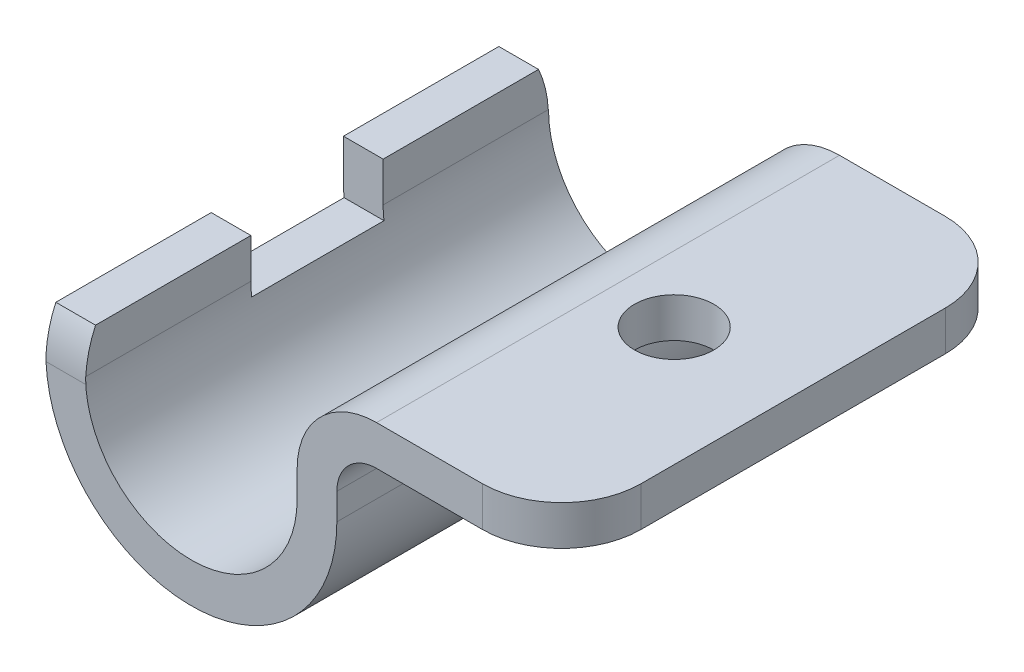
ISO-10303-21;
HEADER;
FILE_DESCRIPTION(('STEP AP214'),'2;1');
FILE_NAME('part.step','',(''),(''),'','','');
FILE_SCHEMA(('AUTOMOTIVE_DESIGN { 1 0 10303 214 1 1 1 1 }'));
ENDSEC;
DATA;
#1=APPLICATION_CONTEXT('core data for automotive mechanical design processes');
#2=APPLICATION_PROTOCOL_DEFINITION('international standard','automotive_design',2000,#1);
#3=PRODUCT_CONTEXT('',#1,'mechanical');
#4=PRODUCT('Part','Part','',(#3));
#5=PRODUCT_RELATED_PRODUCT_CATEGORY('part','',(#4));
#6=PRODUCT_DEFINITION_FORMATION('','',#4);
#7=PRODUCT_DEFINITION_CONTEXT('part definition',#1,'design');
#8=PRODUCT_DEFINITION('design','',#6,#7);
#9=PRODUCT_DEFINITION_SHAPE('','',#8);
#10=(LENGTH_UNIT() NAMED_UNIT(*) SI_UNIT(.MILLI.,.METRE.));
#11=(NAMED_UNIT(*) PLANE_ANGLE_UNIT() SI_UNIT($,.RADIAN.));
#12=(NAMED_UNIT(*) SI_UNIT($,.STERADIAN.) SOLID_ANGLE_UNIT());
#13=UNCERTAINTY_MEASURE_WITH_UNIT(LENGTH_MEASURE(1.E-05),#10,'distance_accuracy_value','');
#14=(GEOMETRIC_REPRESENTATION_CONTEXT(3) GLOBAL_UNCERTAINTY_ASSIGNED_CONTEXT((#13)) GLOBAL_UNIT_ASSIGNED_CONTEXT((#10,
#11,#12)) REPRESENTATION_CONTEXT('',''));
#15=CARTESIAN_POINT('',(0.,0.,0.));
#16=DIRECTION('',(0.,0.,1.));
#17=DIRECTION('',(1.,0.,0.));
#18=AXIS2_PLACEMENT_3D('',#15,#16,#17);
#19=CARTESIAN_POINT('',(-8.,0.,17.5));
#20=DIRECTION('',(-1.,0.,0.));
#21=DIRECTION('',(0.,0.,1.));
#22=AXIS2_PLACEMENT_3D('',#19,#20,#21);
#23=PLANE('',#22);
#24=DIRECTION('',(0.,0.,-1.));
#25=VECTOR('',#24,1.);
#26=CARTESIAN_POINT('',(-8.,3.,17.5));
#27=LINE('',#26,#25);
#28=CARTESIAN_POINT('',(-8.,3.,-5.));
#29=VERTEX_POINT('',#28);
#30=CARTESIAN_POINT('',(-8.,3.,-16.7459666924148));
#31=VERTEX_POINT('',#30);
#32=EDGE_CURVE('E215',#29,#31,#27,.T.);
#33=ORIENTED_EDGE('',*,*,#32,.F.);
#34=DIRECTION('',(0.,-1.,0.));
#35=VECTOR('',#34,1.);
#36=CARTESIAN_POINT('',(-8.,0.,-5.));
#37=LINE('',#36,#35);
#38=CARTESIAN_POINT('',(-8.,0.,-5.));
#39=VERTEX_POINT('',#38);
#40=EDGE_CURVE('E192',#29,#39,#37,.T.);
#41=ORIENTED_EDGE('',*,*,#40,.T.);
#42=DIRECTION('',(0.,0.,-1.));
#43=VECTOR('',#42,1.);
#44=CARTESIAN_POINT('',(-8.,0.,17.5));
#45=LINE('',#44,#43);
#46=CARTESIAN_POINT('',(-8.,0.,-17.4852813742386));
#47=VERTEX_POINT('',#46);
#48=EDGE_CURVE('E223',#39,#47,#45,.T.);
#49=ORIENTED_EDGE('',*,*,#48,.T.);
#50=CARTESIAN_POINT('',(-8.,-0.5,-9.));
#51=DIRECTION('',(1.,0.,0.));
#52=DIRECTION('',(0.,0.,1.));
#53=AXIS2_PLACEMENT_3D('',#50,#51,#52);
#54=CIRCLE('',#53,8.5);
#55=EDGE_CURVE('E439',#47,#31,#54,.T.);
#56=ORIENTED_EDGE('',*,*,#55,.T.);
#57=EDGE_LOOP('',(#33,#41,#49,#56));
#58=FACE_BOUND('',#57,.T.);
#59=ADVANCED_FACE('F31',(#58),#23,.F.);
#60=CARTESIAN_POINT('',(-11.,3.,17.5));
#61=DIRECTION('',(0.,-1.,0.));
#62=DIRECTION('',(0.,0.,-1.));
#63=AXIS2_PLACEMENT_3D('',#60,#61,#62);
#64=PLANE('',#63);
#65=DIRECTION('',(0.,0.,-1.));
#66=VECTOR('',#65,1.);
#67=CARTESIAN_POINT('',(-11.,3.,17.5));
#68=LINE('',#67,#66);
#69=CARTESIAN_POINT('',(-11.,3.,-5.));
#70=VERTEX_POINT('',#69);
#71=CARTESIAN_POINT('',(-11.,3.,-16.7459666924148));
#72=VERTEX_POINT('',#71);
#73=EDGE_CURVE('E203',#70,#72,#68,.T.);
#74=ORIENTED_EDGE('',*,*,#73,.F.);
#75=DIRECTION('',(1.,0.,0.));
#76=VECTOR('',#75,1.);
#77=CARTESIAN_POINT('',(-11.,3.,-5.));
#78=LINE('',#77,#76);
#79=EDGE_CURVE('E185',#70,#29,#78,.T.);
#80=ORIENTED_EDGE('',*,*,#79,.T.);
#81=ORIENTED_EDGE('',*,*,#32,.T.);
#82=DIRECTION('',(1.,0.,0.));
#83=VECTOR('',#82,1.);
#84=CARTESIAN_POINT('',(-43.,3.,-16.7459666924148));
#85=LINE('',#84,#83);
#86=EDGE_CURVE('E210',#72,#31,#85,.T.);
#87=ORIENTED_EDGE('',*,*,#86,.F.);
#88=EDGE_LOOP('',(#74,#80,#81,#87));
#89=FACE_BOUND('',#88,.T.);
#90=ADVANCED_FACE('F208',(#89),#64,.F.);
#91=CARTESIAN_POINT('',(-11.,0.,17.5));
#92=DIRECTION('',(1.,0.,0.));
#93=DIRECTION('',(0.,0.,-1.));
#94=AXIS2_PLACEMENT_3D('',#91,#92,#93);
#95=PLANE('',#94);
#96=DIRECTION('',(0.,0.,-1.));
#97=VECTOR('',#96,1.);
#98=CARTESIAN_POINT('',(-11.,0.,17.5));
#99=LINE('',#98,#97);
#100=CARTESIAN_POINT('',(-11.,0.,-5.));
#101=VERTEX_POINT('',#100);
#102=CARTESIAN_POINT('',(-11.,0.,-17.4852813742386));
#103=VERTEX_POINT('',#102);
#104=EDGE_CURVE('E205',#101,#103,#99,.T.);
#105=ORIENTED_EDGE('',*,*,#104,.F.);
#106=DIRECTION('',(0.,1.,0.));
#107=VECTOR('',#106,1.);
#108=CARTESIAN_POINT('',(-11.,3.,-5.));
#109=LINE('',#108,#107);
#110=EDGE_CURVE('E189',#101,#70,#109,.T.);
#111=ORIENTED_EDGE('',*,*,#110,.T.);
#112=ORIENTED_EDGE('',*,*,#73,.T.);
#113=CARTESIAN_POINT('',(-11.,-0.5,-9.));
#114=DIRECTION('',(1.,0.,0.));
#115=DIRECTION('',(0.,0.,-1.));
#116=AXIS2_PLACEMENT_3D('',#113,#114,#115);
#117=CIRCLE('',#116,8.5);
#118=EDGE_CURVE('E343',#103,#72,#117,.T.);
#119=ORIENTED_EDGE('',*,*,#118,.F.);
#120=EDGE_LOOP('',(#105,#111,#112,#119));
#121=FACE_BOUND('',#120,.T.);
#122=ADVANCED_FACE('F201',(#121),#95,.F.);
#123=CARTESIAN_POINT('',(-8.,0.,17.4852813742386));
#124=VERTEX_POINT('',#123);
#125=CARTESIAN_POINT('',(-8.,0.,5.));
#126=VERTEX_POINT('',#125);
#127=EDGE_CURVE('E227',#124,#126,#45,.T.);
#128=ORIENTED_EDGE('',*,*,#127,.T.);
#129=DIRECTION('',(0.,1.,0.));
#130=VECTOR('',#129,1.);
#131=CARTESIAN_POINT('',(-8.,0.,5.));
#132=LINE('',#131,#130);
#133=CARTESIAN_POINT('',(-8.,3.,5.));
#134=VERTEX_POINT('',#133);
#135=EDGE_CURVE('E46',#126,#134,#132,.T.);
#136=ORIENTED_EDGE('',*,*,#135,.T.);
#137=CARTESIAN_POINT('',(-8.,3.,16.7459666924148));
#138=VERTEX_POINT('',#137);
#139=EDGE_CURVE('E220',#138,#134,#27,.T.);
#140=ORIENTED_EDGE('',*,*,#139,.F.);
#141=CARTESIAN_POINT('',(-8.,-0.5,9.));
#142=DIRECTION('',(1.,0.,0.));
#143=DIRECTION('',(0.,0.,-1.));
#144=AXIS2_PLACEMENT_3D('',#141,#142,#143);
#145=CIRCLE('',#144,8.5);
#146=EDGE_CURVE('E300',#138,#124,#145,.T.);
#147=ORIENTED_EDGE('',*,*,#146,.T.);
#148=EDGE_LOOP('',(#128,#136,#140,#147));
#149=FACE_BOUND('',#148,.T.);
#150=ADVANCED_FACE('F435',(#149),#23,.F.);
#151=ORIENTED_EDGE('',*,*,#139,.T.);
#152=DIRECTION('',(1.,0.,0.));
#153=VECTOR('',#152,1.);
#154=CARTESIAN_POINT('',(-11.,3.,5.));
#155=LINE('',#154,#153);
#156=CARTESIAN_POINT('',(-11.,3.,5.));
#157=VERTEX_POINT('',#156);
#158=EDGE_CURVE('E196',#157,#134,#155,.T.);
#159=ORIENTED_EDGE('',*,*,#158,.F.);
#160=CARTESIAN_POINT('',(-11.,3.,16.7459666924148));
#161=VERTEX_POINT('',#160);
#162=EDGE_CURVE('E211',#161,#157,#68,.T.);
#163=ORIENTED_EDGE('',*,*,#162,.F.);
#164=DIRECTION('',(1.,0.,0.));
#165=VECTOR('',#164,1.);
#166=CARTESIAN_POINT('',(-43.,3.,16.7459666924148));
#167=LINE('',#166,#165);
#168=EDGE_CURVE('E433',#138,#161,#167,.F.);
#169=ORIENTED_EDGE('',*,*,#168,.F.);
#170=EDGE_LOOP('',(#151,#159,#163,#169));
#171=FACE_BOUND('',#170,.T.);
#172=ADVANCED_FACE('F430',(#171),#64,.F.);
#173=ORIENTED_EDGE('',*,*,#162,.T.);
#174=DIRECTION('',(0.,-1.,0.));
#175=VECTOR('',#174,1.);
#176=CARTESIAN_POINT('',(-11.,3.,5.));
#177=LINE('',#176,#175);
#178=CARTESIAN_POINT('',(-11.,0.,5.));
#179=VERTEX_POINT('',#178);
#180=EDGE_CURVE('E197',#157,#179,#177,.T.);
#181=ORIENTED_EDGE('',*,*,#180,.T.);
#182=CARTESIAN_POINT('',(-11.,0.,17.4852813742386));
#183=VERTEX_POINT('',#182);
#184=EDGE_CURVE('E212',#183,#179,#99,.T.);
#185=ORIENTED_EDGE('',*,*,#184,.F.);
#186=CARTESIAN_POINT('',(-11.,-0.5,9.));
#187=DIRECTION('',(1.,0.,0.));
#188=DIRECTION('',(0.,0.,-1.));
#189=AXIS2_PLACEMENT_3D('',#186,#187,#188);
#190=CIRCLE('',#189,8.5);
#191=EDGE_CURVE('E310',#161,#183,#190,.T.);
#192=ORIENTED_EDGE('',*,*,#191,.F.);
#193=EDGE_LOOP('',(#173,#181,#185,#192));
#194=FACE_BOUND('',#193,.T.);
#195=ADVANCED_FACE('F425',(#194),#95,.F.);
#196=CARTESIAN_POINT('',(0.,0.,17.5));
#197=DIRECTION('',(0.,0.,-1.));
#198=DIRECTION('',(-1.,0.,0.));
#199=AXIS2_PLACEMENT_3D('',#196,#197,#198);
#200=CYLINDRICAL_SURFACE('',#199,11.);
#201=DIRECTION('',(0.,0.,-1.));
#202=VECTOR('',#201,1.);
#203=CARTESIAN_POINT('',(-10.9544511501033,-1.,17.5));
#204=LINE('',#203,#202);
#205=CARTESIAN_POINT('',(-10.9544511501033,-1.,5.));
#206=VERTEX_POINT('',#205);
#207=CARTESIAN_POINT('',(-10.9544511501033,-1.,-5.));
#208=VERTEX_POINT('',#207);
#209=EDGE_CURVE('E295',#206,#208,#204,.T.);
#210=ORIENTED_EDGE('',*,*,#209,.T.);
#211=CARTESIAN_POINT('',(0.,0.,-5.));
#212=DIRECTION('',(0.,0.,-1.));
#213=DIRECTION('',(-1.,0.,0.));
#214=AXIS2_PLACEMENT_3D('',#211,#212,#213);
#215=CIRCLE('',#214,11.);
#216=EDGE_CURVE('E285',#208,#101,#215,.T.);
#217=ORIENTED_EDGE('',*,*,#216,.T.);
#218=ORIENTED_EDGE('',*,*,#104,.T.);
#219=CARTESIAN_POINT('',(-10.988630487918,-0.499999999999999,-17.5));
#220=CARTESIAN_POINT('',(-10.9924217220834,-0.416637552685752,-17.5000007370407));
#221=CARTESIAN_POINT('',(-10.9952647985063,-0.333289662361962,-17.4987745534142));
#222=CARTESIAN_POINT('',(-10.999054635867,-0.166622995695295,-17.4938683448271));
#223=CARTESIAN_POINT('',(-11.0000013968048,-0.0833042193524191,-17.4901883198664));
#224=CARTESIAN_POINT('',(-11.,0.,-17.4852813742386));
#225=B_SPLINE_CURVE_WITH_KNOTS('',3,(#219,#220,#221,#222,#223,#224),.UNSPECIFIED.,.F.,.F.,(4,2,
4),(0.,0.250216140329374,0.500432280658749),.UNSPECIFIED.);
#226=CARTESIAN_POINT('',(-10.988630487918,-0.499999999999999,-17.5));
#227=VERTEX_POINT('',#226);
#228=EDGE_CURVE('E336',#227,#103,#225,.T.);
#229=ORIENTED_EDGE('',*,*,#228,.F.);
#230=CARTESIAN_POINT('',(0.,0.,-17.5));
#231=DIRECTION('',(0.,0.,1.));
#232=DIRECTION('',(1.,0.,0.));
#233=AXIS2_PLACEMENT_3D('',#230,#231,#232);
#234=CIRCLE('',#233,11.);
#235=CARTESIAN_POINT('',(11.,0.,-17.5));
#236=VERTEX_POINT('',#235);
#237=EDGE_CURVE('E358',#227,#236,#234,.T.);
#238=ORIENTED_EDGE('',*,*,#237,.T.);
#239=DIRECTION('',(0.,0.,-1.));
#240=VECTOR('',#239,1.);
#241=CARTESIAN_POINT('',(11.,0.,17.5));
#242=LINE('',#241,#240);
#243=CARTESIAN_POINT('',(11.,0.,17.5));
#244=VERTEX_POINT('',#243);
#245=EDGE_CURVE('E393',#244,#236,#242,.T.);
#246=ORIENTED_EDGE('',*,*,#245,.F.);
#247=CARTESIAN_POINT('',(0.,0.,17.5));
#248=DIRECTION('',(0.,0.,1.));
#249=DIRECTION('',(1.,0.,0.));
#250=AXIS2_PLACEMENT_3D('',#247,#248,#249);
#251=CIRCLE('',#250,11.);
#252=CARTESIAN_POINT('',(-10.988630487918,-0.5,17.5));
#253=VERTEX_POINT('',#252);
#254=EDGE_CURVE('E376',#253,#244,#251,.T.);
#255=ORIENTED_EDGE('',*,*,#254,.F.);
#256=CARTESIAN_POINT('',(-11.,0.,17.4852813742386));
#257=CARTESIAN_POINT('',(-11.0000013968048,-0.0833042193524191,17.4901883198664));
#258=CARTESIAN_POINT('',(-10.999054635867,-0.166622995695295,17.493868344827));
#259=CARTESIAN_POINT('',(-10.9952647985063,-0.333289662361962,17.4987745534142));
#260=CARTESIAN_POINT('',(-10.9924217220834,-0.416637552685752,17.5000007370407));
#261=CARTESIAN_POINT('',(-10.988630487918,-0.499999999999999,17.5));
#262=B_SPLINE_CURVE_WITH_KNOTS('',3,(#256,#257,#258,#259,#260,#261),.UNSPECIFIED.,.F.,.F.,(4,2,
4),(0.,0.250216140329374,0.500432280658749),.UNSPECIFIED.);
#263=EDGE_CURVE('E303',#183,#253,#262,.T.);
#264=ORIENTED_EDGE('',*,*,#263,.F.);
#265=ORIENTED_EDGE('',*,*,#184,.T.);
#266=CARTESIAN_POINT('',(0.,0.,5.));
#267=DIRECTION('',(0.,0.,1.));
#268=DIRECTION('',(1.,0.,0.));
#269=AXIS2_PLACEMENT_3D('',#266,#267,#268);
#270=CIRCLE('',#269,11.);
#271=EDGE_CURVE('E287',#179,#206,#270,.T.);
#272=ORIENTED_EDGE('',*,*,#271,.T.);
#273=EDGE_LOOP('',(#210,#217,#218,#229,#238,#246,#255,#264,#265,#272));
#274=FACE_BOUND('',#273,.T.);
#275=ADVANCED_FACE('F312',(#274),#200,.T.);
#276=CARTESIAN_POINT('',(14.,2.,17.5));
#277=DIRECTION('',(0.,0.,-1.));
#278=DIRECTION('',(-1.,0.,0.));
#279=AXIS2_PLACEMENT_3D('',#276,#277,#278);
#280=PLANE('',#279);
#281=DIRECTION('',(1.,0.,0.));
#282=VECTOR('',#281,1.);
#283=CARTESIAN_POINT('',(-43.,-0.5,17.5));
#284=LINE('',#283,#282);
#285=CARTESIAN_POINT('',(-8.,-0.5,17.5));
#286=VERTEX_POINT('',#285);
#287=EDGE_CURVE('E268',#253,#286,#284,.T.);
#288=ORIENTED_EDGE('',*,*,#287,.F.);
#289=ORIENTED_EDGE('',*,*,#254,.T.);
#290=DIRECTION('',(0.,1.,0.));
#291=VECTOR('',#290,1.);
#292=CARTESIAN_POINT('',(11.,1.99999999999998,17.5));
#293=LINE('',#292,#291);
#294=CARTESIAN_POINT('',(11.,1.99999999999998,17.5));
#295=VERTEX_POINT('',#294);
#296=EDGE_CURVE('E378',#244,#295,#293,.T.);
#297=ORIENTED_EDGE('',*,*,#296,.T.);
#298=CARTESIAN_POINT('',(14.,2.,17.5));
#299=DIRECTION('',(0.,0.,-1.));
#300=DIRECTION('',(-1.,0.,0.));
#301=AXIS2_PLACEMENT_3D('',#298,#299,#300);
#302=CIRCLE('',#301,3.);
#303=CARTESIAN_POINT('',(14.,5.,17.5));
#304=VERTEX_POINT('',#303);
#305=EDGE_CURVE('E380',#295,#304,#302,.T.);
#306=ORIENTED_EDGE('',*,*,#305,.T.);
#307=DIRECTION('',(1.,0.,0.));
#308=VECTOR('',#307,1.);
#309=CARTESIAN_POINT('',(14.,5.,17.5));
#310=LINE('',#309,#308);
#311=CARTESIAN_POINT('',(22.,5.,17.5));
#312=VERTEX_POINT('',#311);
#313=EDGE_CURVE('E382',#304,#312,#310,.T.);
#314=ORIENTED_EDGE('',*,*,#313,.T.);
#315=DIRECTION('',(0.,1.,0.));
#316=VECTOR('',#315,1.);
#317=CARTESIAN_POINT('',(22.,2.,17.5));
#318=LINE('',#317,#316);
#319=CARTESIAN_POINT('',(22.,8.,17.5));
#320=VERTEX_POINT('',#319);
#321=EDGE_CURVE('E254',#312,#320,#318,.T.);
#322=ORIENTED_EDGE('',*,*,#321,.T.);
#323=DIRECTION('',(-1.,0.,0.));
#324=VECTOR('',#323,1.);
#325=CARTESIAN_POINT('',(14.,8.,17.5));
#326=LINE('',#325,#324);
#327=CARTESIAN_POINT('',(14.,8.,17.5));
#328=VERTEX_POINT('',#327);
#329=EDGE_CURVE('E367',#320,#328,#326,.T.);
#330=ORIENTED_EDGE('',*,*,#329,.T.);
#331=CARTESIAN_POINT('',(14.,2.,17.5));
#332=DIRECTION('',(0.,0.,1.));
#333=DIRECTION('',(-1.,0.,0.));
#334=AXIS2_PLACEMENT_3D('',#331,#332,#333);
#335=CIRCLE('',#334,6.);
#336=CARTESIAN_POINT('',(8.,1.99999999999996,17.5));
#337=VERTEX_POINT('',#336);
#338=EDGE_CURVE('E369',#328,#337,#335,.T.);
#339=ORIENTED_EDGE('',*,*,#338,.T.);
#340=DIRECTION('',(0.,-1.,0.));
#341=VECTOR('',#340,1.);
#342=CARTESIAN_POINT('',(8.,1.99999999999996,17.5));
#343=LINE('',#342,#341);
#344=CARTESIAN_POINT('',(8.,0.,17.5));
#345=VERTEX_POINT('',#344);
#346=EDGE_CURVE('E371',#337,#345,#343,.T.);
#347=ORIENTED_EDGE('',*,*,#346,.T.);
#348=CARTESIAN_POINT('',(0.,0.,17.5));
#349=DIRECTION('',(0.,0.,-1.));
#350=DIRECTION('',(1.,0.,0.));
#351=AXIS2_PLACEMENT_3D('',#348,#349,#350);
#352=CIRCLE('',#351,8.);
#353=CARTESIAN_POINT('',(-8.,0.,17.5));
#354=VERTEX_POINT('',#353);
#355=EDGE_CURVE('E373',#345,#354,#352,.T.);
#356=ORIENTED_EDGE('',*,*,#355,.T.);
#357=DIRECTION('',(0.,1.,0.));
#358=VECTOR('',#357,1.);
#359=CARTESIAN_POINT('',(-8.,8.,17.5));
#360=LINE('',#359,#358);
#361=EDGE_CURVE('E301',#286,#354,#360,.T.);
#362=ORIENTED_EDGE('',*,*,#361,.F.);
#363=EDGE_LOOP('',(#288,#289,#297,#306,#314,#322,#330,#339,#347,#356,#362));
#364=FACE_BOUND('',#363,.T.);
#365=ADVANCED_FACE('F417',(#364),#280,.F.);
#366=CARTESIAN_POINT('',(14.,2.,-17.5));
#367=DIRECTION('',(0.,0.,-1.));
#368=DIRECTION('',(-1.,0.,0.));
#369=AXIS2_PLACEMENT_3D('',#366,#367,#368);
#370=PLANE('',#369);
#371=ORIENTED_EDGE('',*,*,#237,.F.);
#372=DIRECTION('',(1.,0.,0.));
#373=VECTOR('',#372,1.);
#374=CARTESIAN_POINT('',(-43.,-0.5,-17.5));
#375=LINE('',#374,#373);
#376=CARTESIAN_POINT('',(-8.,-0.499999999999999,-17.5));
#377=VERTEX_POINT('',#376);
#378=EDGE_CURVE('E265',#227,#377,#375,.T.);
#379=ORIENTED_EDGE('',*,*,#378,.T.);
#380=DIRECTION('',(0.,1.,0.));
#381=VECTOR('',#380,1.);
#382=CARTESIAN_POINT('',(-8.,2.,-17.5));
#383=LINE('',#382,#381);
#384=CARTESIAN_POINT('',(-8.,0.,-17.5));
#385=VERTEX_POINT('',#384);
#386=EDGE_CURVE('E257',#377,#385,#383,.T.);
#387=ORIENTED_EDGE('',*,*,#386,.T.);
#388=CARTESIAN_POINT('',(0.,0.,-17.5));
#389=DIRECTION('',(0.,0.,-1.));
#390=DIRECTION('',(1.,0.,0.));
#391=AXIS2_PLACEMENT_3D('',#388,#389,#390);
#392=CIRCLE('',#391,8.);
#393=CARTESIAN_POINT('',(8.,0.,-17.5));
#394=VERTEX_POINT('',#393);
#395=EDGE_CURVE('E355',#394,#385,#392,.T.);
#396=ORIENTED_EDGE('',*,*,#395,.F.);
#397=DIRECTION('',(0.,-1.,0.));
#398=VECTOR('',#397,1.);
#399=CARTESIAN_POINT('',(8.,1.99999999999996,-17.5));
#400=LINE('',#399,#398);
#401=CARTESIAN_POINT('',(8.,1.99999999999996,-17.5));
#402=VERTEX_POINT('',#401);
#403=EDGE_CURVE('E353',#402,#394,#400,.T.);
#404=ORIENTED_EDGE('',*,*,#403,.F.);
#405=CARTESIAN_POINT('',(14.,2.,-17.5));
#406=DIRECTION('',(0.,0.,1.));
#407=DIRECTION('',(-1.,0.,0.));
#408=AXIS2_PLACEMENT_3D('',#405,#406,#407);
#409=CIRCLE('',#408,6.);
#410=CARTESIAN_POINT('',(14.,8.,-17.5));
#411=VERTEX_POINT('',#410);
#412=EDGE_CURVE('E351',#411,#402,#409,.T.);
#413=ORIENTED_EDGE('',*,*,#412,.F.);
#414=DIRECTION('',(-1.,0.,0.));
#415=VECTOR('',#414,1.);
#416=CARTESIAN_POINT('',(14.,8.,-17.5));
#417=LINE('',#416,#415);
#418=CARTESIAN_POINT('',(22.,8.,-17.5));
#419=VERTEX_POINT('',#418);
#420=EDGE_CURVE('E261',#419,#411,#417,.T.);
#421=ORIENTED_EDGE('',*,*,#420,.F.);
#422=DIRECTION('',(0.,1.,0.));
#423=VECTOR('',#422,1.);
#424=CARTESIAN_POINT('',(22.,5.,-17.5));
#425=LINE('',#424,#423);
#426=CARTESIAN_POINT('',(22.,5.,-17.5));
#427=VERTEX_POINT('',#426);
#428=EDGE_CURVE('E248',#419,#427,#425,.F.);
#429=ORIENTED_EDGE('',*,*,#428,.T.);
#430=DIRECTION('',(1.,0.,0.));
#431=VECTOR('',#430,1.);
#432=CARTESIAN_POINT('',(14.,5.,-17.5));
#433=LINE('',#432,#431);
#434=CARTESIAN_POINT('',(14.,5.,-17.5));
#435=VERTEX_POINT('',#434);
#436=EDGE_CURVE('E364',#435,#427,#433,.T.);
#437=ORIENTED_EDGE('',*,*,#436,.F.);
#438=CARTESIAN_POINT('',(14.,2.,-17.5));
#439=DIRECTION('',(0.,0.,-1.));
#440=DIRECTION('',(-1.,0.,0.));
#441=AXIS2_PLACEMENT_3D('',#438,#439,#440);
#442=CIRCLE('',#441,3.);
#443=CARTESIAN_POINT('',(11.,1.99999999999998,-17.5));
#444=VERTEX_POINT('',#443);
#445=EDGE_CURVE('E362',#444,#435,#442,.T.);
#446=ORIENTED_EDGE('',*,*,#445,.F.);
#447=DIRECTION('',(0.,1.,0.));
#448=VECTOR('',#447,1.);
#449=CARTESIAN_POINT('',(11.,1.99999999999998,-17.5));
#450=LINE('',#449,#448);
#451=EDGE_CURVE('E360',#236,#444,#450,.T.);
#452=ORIENTED_EDGE('',*,*,#451,.F.);
#453=EDGE_LOOP('',(#371,#379,#387,#396,#404,#413,#421,#429,#437,#446,#452));
#454=FACE_BOUND('',#453,.T.);
#455=ADVANCED_FACE('F407',(#454),#370,.T.);
#456=CARTESIAN_POINT('',(28.,8.,17.5));
#457=DIRECTION('',(-1.,0.,0.));
#458=DIRECTION('',(0.,0.,1.));
#459=AXIS2_PLACEMENT_3D('',#456,#457,#458);
#460=PLANE('',#459);
#461=DIRECTION('',(0.,0.,-1.));
#462=VECTOR('',#461,1.);
#463=CARTESIAN_POINT('',(28.,5.,17.5));
#464=LINE('',#463,#462);
#465=CARTESIAN_POINT('',(28.,5.,11.5));
#466=VERTEX_POINT('',#465);
#467=CARTESIAN_POINT('',(28.,5.,-11.5));
#468=VERTEX_POINT('',#467);
#469=EDGE_CURVE('E385',#466,#468,#464,.T.);
#470=ORIENTED_EDGE('',*,*,#469,.T.);
#471=DIRECTION('',(0.,1.,0.));
#472=VECTOR('',#471,1.);
#473=CARTESIAN_POINT('',(28.,8.,-11.5));
#474=LINE('',#473,#472);
#475=CARTESIAN_POINT('',(28.,8.,-11.5));
#476=VERTEX_POINT('',#475);
#477=EDGE_CURVE('E241',#468,#476,#474,.T.);
#478=ORIENTED_EDGE('',*,*,#477,.T.);
#479=DIRECTION('',(0.,0.,-1.));
#480=VECTOR('',#479,1.);
#481=CARTESIAN_POINT('',(28.,8.,17.5));
#482=LINE('',#481,#480);
#483=CARTESIAN_POINT('',(28.,8.,11.5));
#484=VERTEX_POINT('',#483);
#485=EDGE_CURVE('E236',#484,#476,#482,.T.);
#486=ORIENTED_EDGE('',*,*,#485,.F.);
#487=DIRECTION('',(0.,1.,0.));
#488=VECTOR('',#487,1.);
#489=CARTESIAN_POINT('',(28.,8.,11.5));
#490=LINE('',#489,#488);
#491=EDGE_CURVE('E239',#484,#466,#490,.F.);
#492=ORIENTED_EDGE('',*,*,#491,.T.);
#493=EDGE_LOOP('',(#470,#478,#486,#492));
#494=FACE_BOUND('',#493,.T.);
#495=ADVANCED_FACE('F33',(#494),#460,.F.);
#496=CARTESIAN_POINT('',(14.,8.,17.5));
#497=DIRECTION('',(0.,-1.,0.));
#498=DIRECTION('',(0.,0.,-1.));
#499=AXIS2_PLACEMENT_3D('',#496,#497,#498);
#500=PLANE('',#499);
#501=CARTESIAN_POINT('',(19.,8.,0.));
#502=DIRECTION('',(0.,1.,0.));
#503=DIRECTION('',(0.,0.,1.));
#504=AXIS2_PLACEMENT_3D('',#501,#502,#503);
#505=CIRCLE('',#504,3.);
#506=CARTESIAN_POINT('',(19.,8.,3.));
#507=VERTEX_POINT('',#506);
#508=EDGE_CURVE('E262',#507,#507,#505,.T.);
#509=ORIENTED_EDGE('',*,*,#508,.F.);
#510=EDGE_LOOP('',(#509));
#511=FACE_BOUND('',#510,.T.);
#512=ORIENTED_EDGE('',*,*,#485,.T.);
#513=CARTESIAN_POINT('',(22.,8.,-11.5));
#514=DIRECTION('',(0.,-1.,0.));
#515=DIRECTION('',(0.,0.,-1.));
#516=AXIS2_PLACEMENT_3D('',#513,#514,#515);
#517=CIRCLE('',#516,6.);
#518=EDGE_CURVE('E246',#476,#419,#517,.F.);
#519=ORIENTED_EDGE('',*,*,#518,.T.);
#520=ORIENTED_EDGE('',*,*,#420,.T.);
#521=DIRECTION('',(0.,0.,-1.));
#522=VECTOR('',#521,1.);
#523=CARTESIAN_POINT('',(14.,8.,17.5));
#524=LINE('',#523,#522);
#525=EDGE_CURVE('E233',#328,#411,#524,.T.);
#526=ORIENTED_EDGE('',*,*,#525,.F.);
#527=ORIENTED_EDGE('',*,*,#329,.F.);
#528=CARTESIAN_POINT('',(22.,8.,11.5));
#529=DIRECTION('',(0.,-1.,0.));
#530=DIRECTION('',(0.,0.,-1.));
#531=AXIS2_PLACEMENT_3D('',#528,#529,#530);
#532=CIRCLE('',#531,6.);
#533=EDGE_CURVE('E244',#320,#484,#532,.F.);
#534=ORIENTED_EDGE('',*,*,#533,.T.);
#535=EDGE_LOOP('',(#512,#519,#520,#526,#527,#534));
#536=FACE_BOUND('',#535,.T.);
#537=ADVANCED_FACE('F456',(#511,#536),#500,.F.);
#538=CARTESIAN_POINT('',(14.,2.,17.5));
#539=DIRECTION('',(0.,0.,-1.));
#540=DIRECTION('',(-1.,0.,0.));
#541=AXIS2_PLACEMENT_3D('',#538,#539,#540);
#542=CYLINDRICAL_SURFACE('',#541,6.);
#543=ORIENTED_EDGE('',*,*,#412,.T.);
#544=DIRECTION('',(0.,0.,-1.));
#545=VECTOR('',#544,1.);
#546=CARTESIAN_POINT('',(8.,1.99999999999996,17.5));
#547=LINE('',#546,#545);
#548=EDGE_CURVE('E230',#337,#402,#547,.T.);
#549=ORIENTED_EDGE('',*,*,#548,.F.);
#550=ORIENTED_EDGE('',*,*,#338,.F.);
#551=ORIENTED_EDGE('',*,*,#525,.T.);
#552=EDGE_LOOP('',(#543,#549,#550,#551));
#553=FACE_BOUND('',#552,.T.);
#554=ADVANCED_FACE('F452',(#553),#542,.T.);
#555=CARTESIAN_POINT('',(8.,1.99999999999996,17.5));
#556=DIRECTION('',(1.,0.,0.));
#557=DIRECTION('',(0.,0.,-1.));
#558=AXIS2_PLACEMENT_3D('',#555,#556,#557);
#559=PLANE('',#558);
#560=ORIENTED_EDGE('',*,*,#403,.T.);
#561=DIRECTION('',(0.,0.,-1.));
#562=VECTOR('',#561,1.);
#563=CARTESIAN_POINT('',(8.,0.,17.5));
#564=LINE('',#563,#562);
#565=EDGE_CURVE('E226',#345,#394,#564,.T.);
#566=ORIENTED_EDGE('',*,*,#565,.F.);
#567=ORIENTED_EDGE('',*,*,#346,.F.);
#568=ORIENTED_EDGE('',*,*,#548,.T.);
#569=EDGE_LOOP('',(#560,#566,#567,#568));
#570=FACE_BOUND('',#569,.T.);
#571=ADVANCED_FACE('F447',(#570),#559,.F.);
#572=CARTESIAN_POINT('',(0.,0.,17.5));
#573=DIRECTION('',(0.,0.,-1.));
#574=DIRECTION('',(-1.,0.,0.));
#575=AXIS2_PLACEMENT_3D('',#572,#573,#574);
#576=CYLINDRICAL_SURFACE('',#575,8.);
#577=ORIENTED_EDGE('',*,*,#48,.F.);
#578=CARTESIAN_POINT('',(0.,0.,-5.));
#579=DIRECTION('',(0.,0.,-1.));
#580=DIRECTION('',(-1.,0.,0.));
#581=AXIS2_PLACEMENT_3D('',#578,#579,#580);
#582=CIRCLE('',#581,8.);
#583=CARTESIAN_POINT('',(-7.93725393319377,-1.,-5.));
#584=VERTEX_POINT('',#583);
#585=EDGE_CURVE('E11',#39,#584,#582,.F.);
#586=ORIENTED_EDGE('',*,*,#585,.T.);
#587=DIRECTION('',(0.,0.,-1.));
#588=VECTOR('',#587,1.);
#589=CARTESIAN_POINT('',(-7.93725393319377,-1.,17.5));
#590=LINE('',#589,#588);
#591=CARTESIAN_POINT('',(-7.93725393319377,-1.,5.));
#592=VERTEX_POINT('',#591);
#593=EDGE_CURVE('E39',#584,#592,#590,.F.);
#594=ORIENTED_EDGE('',*,*,#593,.T.);
#595=CARTESIAN_POINT('',(0.,0.,5.));
#596=DIRECTION('',(0.,0.,1.));
#597=DIRECTION('',(1.,0.,0.));
#598=AXIS2_PLACEMENT_3D('',#595,#596,#597);
#599=CIRCLE('',#598,8.);
#600=EDGE_CURVE('E270',#592,#126,#599,.F.);
#601=ORIENTED_EDGE('',*,*,#600,.T.);
#602=ORIENTED_EDGE('',*,*,#127,.F.);
#603=EDGE_CURVE('E224',#354,#124,#45,.T.);
#604=ORIENTED_EDGE('',*,*,#603,.F.);
#605=ORIENTED_EDGE('',*,*,#355,.F.);
#606=ORIENTED_EDGE('',*,*,#565,.T.);
#607=ORIENTED_EDGE('',*,*,#395,.T.);
#608=DIRECTION('',(0.,0.,-1.));
#609=VECTOR('',#608,1.);
#610=CARTESIAN_POINT('',(-8.,0.,17.5));
#611=LINE('',#610,#609);
#612=EDGE_CURVE('E344',#385,#47,#611,.F.);
#613=ORIENTED_EDGE('',*,*,#612,.T.);
#614=EDGE_LOOP('',(#577,#586,#594,#601,#602,#604,#605,#606,#607,#613));
#615=FACE_BOUND('',#614,.T.);
#616=ADVANCED_FACE('F274',(#615),#576,.F.);
#617=CARTESIAN_POINT('',(11.,1.99999999999998,17.5));
#618=DIRECTION('',(-1.,0.,0.));
#619=DIRECTION('',(0.,0.,1.));
#620=AXIS2_PLACEMENT_3D('',#617,#618,#619);
#621=PLANE('',#620);
#622=ORIENTED_EDGE('',*,*,#451,.T.);
#623=DIRECTION('',(0.,0.,-1.));
#624=VECTOR('',#623,1.);
#625=CARTESIAN_POINT('',(11.,1.99999999999998,17.5));
#626=LINE('',#625,#624);
#627=EDGE_CURVE('E391',#295,#444,#626,.T.);
#628=ORIENTED_EDGE('',*,*,#627,.F.);
#629=ORIENTED_EDGE('',*,*,#296,.F.);
#630=ORIENTED_EDGE('',*,*,#245,.T.);
#631=EDGE_LOOP('',(#622,#628,#629,#630));
#632=FACE_BOUND('',#631,.T.);
#633=ADVANCED_FACE('F413',(#632),#621,.F.);
#634=CARTESIAN_POINT('',(14.,2.,17.5));
#635=DIRECTION('',(0.,0.,-1.));
#636=DIRECTION('',(-1.,0.,0.));
#637=AXIS2_PLACEMENT_3D('',#634,#635,#636);
#638=CYLINDRICAL_SURFACE('',#637,3.);
#639=ORIENTED_EDGE('',*,*,#445,.T.);
#640=DIRECTION('',(0.,0.,-1.));
#641=VECTOR('',#640,1.);
#642=CARTESIAN_POINT('',(14.,5.,17.5));
#643=LINE('',#642,#641);
#644=EDGE_CURVE('E388',#304,#435,#643,.T.);
#645=ORIENTED_EDGE('',*,*,#644,.F.);
#646=ORIENTED_EDGE('',*,*,#305,.F.);
#647=ORIENTED_EDGE('',*,*,#627,.T.);
#648=EDGE_LOOP('',(#639,#645,#646,#647));
#649=FACE_BOUND('',#648,.T.);
#650=ADVANCED_FACE('F510',(#649),#638,.F.);
#651=CARTESIAN_POINT('',(14.,5.,17.5));
#652=DIRECTION('',(0.,1.,0.));
#653=DIRECTION('',(0.,0.,1.));
#654=AXIS2_PLACEMENT_3D('',#651,#652,#653);
#655=PLANE('',#654);
#656=CARTESIAN_POINT('',(19.,5.,0.));
#657=DIRECTION('',(0.,1.,0.));
#658=DIRECTION('',(0.,0.,1.));
#659=AXIS2_PLACEMENT_3D('',#656,#657,#658);
#660=CIRCLE('',#659,3.);
#661=CARTESIAN_POINT('',(19.,5.,3.));
#662=VERTEX_POINT('',#661);
#663=EDGE_CURVE('E258',#662,#662,#660,.T.);
#664=ORIENTED_EDGE('',*,*,#663,.T.);
#665=EDGE_LOOP('',(#664));
#666=FACE_BOUND('',#665,.T.);
#667=ORIENTED_EDGE('',*,*,#436,.T.);
#668=CARTESIAN_POINT('',(22.,5.,-11.5));
#669=DIRECTION('',(0.,1.,0.));
#670=DIRECTION('',(0.,0.,1.));
#671=AXIS2_PLACEMENT_3D('',#668,#669,#670);
#672=CIRCLE('',#671,6.);
#673=EDGE_CURVE('E252',#427,#468,#672,.F.);
#674=ORIENTED_EDGE('',*,*,#673,.T.);
#675=ORIENTED_EDGE('',*,*,#469,.F.);
#676=CARTESIAN_POINT('',(22.,5.,11.5));
#677=DIRECTION('',(0.,1.,0.));
#678=DIRECTION('',(0.,0.,1.));
#679=AXIS2_PLACEMENT_3D('',#676,#677,#678);
#680=CIRCLE('',#679,6.);
#681=EDGE_CURVE('E250',#466,#312,#680,.F.);
#682=ORIENTED_EDGE('',*,*,#681,.T.);
#683=ORIENTED_EDGE('',*,*,#313,.F.);
#684=ORIENTED_EDGE('',*,*,#644,.T.);
#685=EDGE_LOOP('',(#667,#674,#675,#682,#683,#684));
#686=FACE_BOUND('',#685,.T.);
#687=ADVANCED_FACE('F465',(#666,#686),#655,.F.);
#688=CARTESIAN_POINT('',(22.,8.,-11.5));
#689=DIRECTION('',(0.,-1.,0.));
#690=DIRECTION('',(0.,0.,-1.));
#691=AXIS2_PLACEMENT_3D('',#688,#689,#690);
#692=CYLINDRICAL_SURFACE('',#691,6.);
#693=ORIENTED_EDGE('',*,*,#673,.F.);
#694=ORIENTED_EDGE('',*,*,#428,.F.);
#695=ORIENTED_EDGE('',*,*,#518,.F.);
#696=ORIENTED_EDGE('',*,*,#477,.F.);
#697=EDGE_LOOP('',(#693,#694,#695,#696));
#698=FACE_BOUND('',#697,.T.);
#699=ADVANCED_FACE('F461',(#698),#692,.T.);
#700=CARTESIAN_POINT('',(22.,2.,11.5));
#701=DIRECTION('',(0.,1.,0.));
#702=DIRECTION('',(0.,0.,1.));
#703=AXIS2_PLACEMENT_3D('',#700,#701,#702);
#704=CYLINDRICAL_SURFACE('',#703,6.);
#705=ORIENTED_EDGE('',*,*,#681,.F.);
#706=ORIENTED_EDGE('',*,*,#491,.F.);
#707=ORIENTED_EDGE('',*,*,#533,.F.);
#708=ORIENTED_EDGE('',*,*,#321,.F.);
#709=EDGE_LOOP('',(#705,#706,#707,#708));
#710=FACE_BOUND('',#709,.T.);
#711=ADVANCED_FACE('F471',(#710),#704,.T.);
#712=CARTESIAN_POINT('',(19.,-11.,0.));
#713=DIRECTION('',(0.,1.,0.));
#714=DIRECTION('',(0.,0.,1.));
#715=AXIS2_PLACEMENT_3D('',#712,#713,#714);
#716=CYLINDRICAL_SURFACE('',#715,3.);
#717=ORIENTED_EDGE('',*,*,#508,.T.);
#718=EDGE_LOOP('',(#717));
#719=FACE_BOUND('',#718,.T.);
#720=ORIENTED_EDGE('',*,*,#663,.F.);
#721=EDGE_LOOP('',(#720));
#722=FACE_BOUND('',#721,.T.);
#723=ADVANCED_FACE('F332',(#719,#722),#716,.F.);
#724=CARTESIAN_POINT('',(-43.,-0.5,-9.));
#725=DIRECTION('',(1.,0.,0.));
#726=DIRECTION('',(0.,0.,-1.));
#727=AXIS2_PLACEMENT_3D('',#724,#725,#726);
#728=CYLINDRICAL_SURFACE('',#727,8.5);
#729=ORIENTED_EDGE('',*,*,#86,.T.);
#730=ORIENTED_EDGE('',*,*,#55,.F.);
#731=EDGE_CURVE('E405',#377,#47,#54,.T.);
#732=ORIENTED_EDGE('',*,*,#731,.F.);
#733=ORIENTED_EDGE('',*,*,#378,.F.);
#734=ORIENTED_EDGE('',*,*,#228,.T.);
#735=ORIENTED_EDGE('',*,*,#118,.T.);
#736=EDGE_LOOP('',(#729,#730,#732,#733,#734,#735));
#737=FACE_BOUND('',#736,.T.);
#738=ADVANCED_FACE('F327',(#737),#728,.T.);
#739=CARTESIAN_POINT('',(-8.,-0.5,-9.));
#740=DIRECTION('',(-1.,0.,0.));
#741=DIRECTION('',(0.,0.,1.));
#742=AXIS2_PLACEMENT_3D('',#739,#740,#741);
#743=PLANE('',#742);
#744=ORIENTED_EDGE('',*,*,#386,.F.);
#745=ORIENTED_EDGE('',*,*,#731,.T.);
#746=ORIENTED_EDGE('',*,*,#612,.F.);
#747=EDGE_LOOP('',(#744,#745,#746));
#748=FACE_BOUND('',#747,.T.);
#749=ADVANCED_FACE('F322',(#748),#743,.T.);
#750=CARTESIAN_POINT('',(-43.,-0.5,9.));
#751=DIRECTION('',(1.,0.,0.));
#752=DIRECTION('',(0.,0.,-1.));
#753=AXIS2_PLACEMENT_3D('',#750,#751,#752);
#754=CYLINDRICAL_SURFACE('',#753,8.5);
#755=ORIENTED_EDGE('',*,*,#168,.T.);
#756=ORIENTED_EDGE('',*,*,#191,.T.);
#757=ORIENTED_EDGE('',*,*,#263,.T.);
#758=ORIENTED_EDGE('',*,*,#287,.T.);
#759=EDGE_CURVE('E54',#124,#286,#145,.T.);
#760=ORIENTED_EDGE('',*,*,#759,.F.);
#761=ORIENTED_EDGE('',*,*,#146,.F.);
#762=EDGE_LOOP('',(#755,#756,#757,#758,#760,#761));
#763=FACE_BOUND('',#762,.T.);
#764=ADVANCED_FACE('F316',(#763),#754,.T.);
#765=CARTESIAN_POINT('',(-8.,-0.5,9.));
#766=DIRECTION('',(1.,0.,0.));
#767=DIRECTION('',(0.,0.,-1.));
#768=AXIS2_PLACEMENT_3D('',#765,#766,#767);
#769=PLANE('',#768);
#770=ORIENTED_EDGE('',*,*,#759,.T.);
#771=ORIENTED_EDGE('',*,*,#361,.T.);
#772=ORIENTED_EDGE('',*,*,#603,.T.);
#773=EDGE_LOOP('',(#770,#771,#772));
#774=FACE_BOUND('',#773,.T.);
#775=ADVANCED_FACE('F321',(#774),#769,.F.);
#776=CARTESIAN_POINT('',(-11.,3.,-5.));
#777=DIRECTION('',(0.,0.,-1.));
#778=DIRECTION('',(-1.,0.,0.));
#779=AXIS2_PLACEMENT_3D('',#776,#777,#778);
#780=PLANE('',#779);
#781=DIRECTION('',(1.,0.,0.));
#782=VECTOR('',#781,1.);
#783=CARTESIAN_POINT('',(-11.,-1.,-5.));
#784=LINE('',#783,#782);
#785=EDGE_CURVE('E281',#208,#584,#784,.T.);
#786=ORIENTED_EDGE('',*,*,#785,.T.);
#787=ORIENTED_EDGE('',*,*,#585,.F.);
#788=ORIENTED_EDGE('',*,*,#40,.F.);
#789=ORIENTED_EDGE('',*,*,#79,.F.);
#790=ORIENTED_EDGE('',*,*,#110,.F.);
#791=ORIENTED_EDGE('',*,*,#216,.F.);
#792=EDGE_LOOP('',(#786,#787,#788,#789,#790,#791));
#793=FACE_BOUND('',#792,.T.);
#794=ADVANCED_FACE('F188',(#793),#780,.F.);
#795=CARTESIAN_POINT('',(-11.,-1.,-5.));
#796=DIRECTION('',(0.,-1.,0.));
#797=DIRECTION('',(0.,0.,-1.));
#798=AXIS2_PLACEMENT_3D('',#795,#796,#797);
#799=PLANE('',#798);
#800=DIRECTION('',(1.,0.,0.));
#801=VECTOR('',#800,1.);
#802=CARTESIAN_POINT('',(-11.,-1.,5.));
#803=LINE('',#802,#801);
#804=EDGE_CURVE('E284',#206,#592,#803,.T.);
#805=ORIENTED_EDGE('',*,*,#804,.T.);
#806=ORIENTED_EDGE('',*,*,#593,.F.);
#807=ORIENTED_EDGE('',*,*,#785,.F.);
#808=ORIENTED_EDGE('',*,*,#209,.F.);
#809=EDGE_LOOP('',(#805,#806,#807,#808));
#810=FACE_BOUND('',#809,.T.);
#811=ADVANCED_FACE('F280',(#810),#799,.F.);
#812=CARTESIAN_POINT('',(-11.,3.,5.));
#813=DIRECTION('',(0.,0.,1.));
#814=DIRECTION('',(1.,0.,0.));
#815=AXIS2_PLACEMENT_3D('',#812,#813,#814);
#816=PLANE('',#815);
#817=ORIENTED_EDGE('',*,*,#180,.F.);
#818=ORIENTED_EDGE('',*,*,#158,.T.);
#819=ORIENTED_EDGE('',*,*,#135,.F.);
#820=ORIENTED_EDGE('',*,*,#600,.F.);
#821=ORIENTED_EDGE('',*,*,#804,.F.);
#822=ORIENTED_EDGE('',*,*,#271,.F.);
#823=EDGE_LOOP('',(#817,#818,#819,#820,#821,#822));
#824=FACE_BOUND('',#823,.T.);
#825=ADVANCED_FACE('F428',(#824),#816,.F.);
#826=CLOSED_SHELL('',(#59,#90,#122,#150,#172,#195,#275,#365,#455,#495,#537,#554,#571,#616,#633,
#650,#687,#699,#711,#723,#738,#749,#764,#775,#794,#811,#825));
#827=MANIFOLD_SOLID_BREP('B2',#826);
#828=ADVANCED_BREP_SHAPE_REPRESENTATION('',(#18,#827),#14);
#829=SHAPE_DEFINITION_REPRESENTATION(#9,#828);
ENDSEC;
END-ISO-10303-21;
